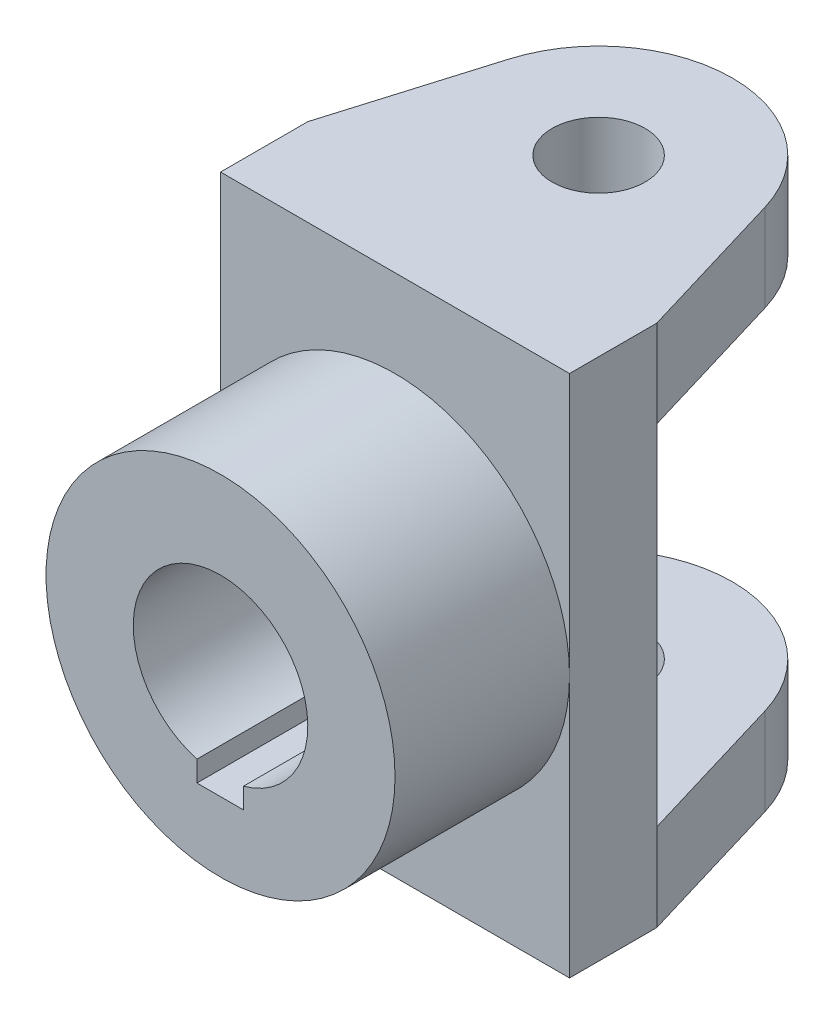
ISO-10303-21;
HEADER;
FILE_DESCRIPTION(('STEP AP214'),'2;1');
FILE_NAME('part.step','',(''),(''),'','','');
FILE_SCHEMA(('AUTOMOTIVE_DESIGN { 1 0 10303 214 1 1 1 1 }'));
ENDSEC;
DATA;
#1=APPLICATION_CONTEXT('core data for automotive mechanical design processes');
#2=APPLICATION_PROTOCOL_DEFINITION('international standard','automotive_design',2000,#1);
#3=PRODUCT_CONTEXT('',#1,'mechanical');
#4=PRODUCT('Part','Part','',(#3));
#5=PRODUCT_RELATED_PRODUCT_CATEGORY('part','',(#4));
#6=PRODUCT_DEFINITION_FORMATION('','',#4);
#7=PRODUCT_DEFINITION_CONTEXT('part definition',#1,'design');
#8=PRODUCT_DEFINITION('design','',#6,#7);
#9=PRODUCT_DEFINITION_SHAPE('','',#8);
#10=(LENGTH_UNIT() NAMED_UNIT(*) SI_UNIT(.MILLI.,.METRE.));
#11=(NAMED_UNIT(*) PLANE_ANGLE_UNIT() SI_UNIT($,.RADIAN.));
#12=(NAMED_UNIT(*) SI_UNIT($,.STERADIAN.) SOLID_ANGLE_UNIT());
#13=UNCERTAINTY_MEASURE_WITH_UNIT(LENGTH_MEASURE(1.E-05),#10,'distance_accuracy_value','');
#14=(GEOMETRIC_REPRESENTATION_CONTEXT(3) GLOBAL_UNCERTAINTY_ASSIGNED_CONTEXT((#13)) GLOBAL_UNIT_ASSIGNED_CONTEXT((#10,
#11,#12)) REPRESENTATION_CONTEXT('',''));
#15=CARTESIAN_POINT('',(0.,0.,0.));
#16=DIRECTION('',(0.,0.,1.));
#17=DIRECTION('',(1.,0.,0.));
#18=AXIS2_PLACEMENT_3D('',#15,#16,#17);
#19=CARTESIAN_POINT('',(0.,0.,0.));
#20=DIRECTION('',(0.,0.,-1.));
#21=DIRECTION('',(-1.,0.,0.));
#22=AXIS2_PLACEMENT_3D('',#19,#20,#21);
#23=PLANE('',#22);
#24=DIRECTION('',(0.,1.,0.));
#25=VECTOR('',#24,1.);
#26=CARTESIAN_POINT('',(30.,-45.,0.));
#27=LINE('',#26,#25);
#28=CARTESIAN_POINT('',(30.,-30.,0.));
#29=VERTEX_POINT('',#28);
#30=CARTESIAN_POINT('',(30.,30.,0.));
#31=VERTEX_POINT('',#30);
#32=EDGE_CURVE('E40',#29,#31,#27,.T.);
#33=ORIENTED_EDGE('',*,*,#32,.F.);
#34=DIRECTION('',(1.,0.,0.));
#35=VECTOR('',#34,1.);
#36=CARTESIAN_POINT('',(-30.,-30.,0.));
#37=LINE('',#36,#35);
#38=CARTESIAN_POINT('',(-30.,-30.,0.));
#39=VERTEX_POINT('',#38);
#40=EDGE_CURVE('E169',#39,#29,#37,.T.);
#41=ORIENTED_EDGE('',*,*,#40,.F.);
#42=DIRECTION('',(0.,-1.,0.));
#43=VECTOR('',#42,1.);
#44=CARTESIAN_POINT('',(-30.,-45.,0.));
#45=LINE('',#44,#43);
#46=CARTESIAN_POINT('',(-30.,30.,0.));
#47=VERTEX_POINT('',#46);
#48=EDGE_CURVE('E289',#47,#39,#45,.T.);
#49=ORIENTED_EDGE('',*,*,#48,.F.);
#50=DIRECTION('',(1.,0.,0.));
#51=VECTOR('',#50,1.);
#52=CARTESIAN_POINT('',(-30.,30.,0.));
#53=LINE('',#52,#51);
#54=EDGE_CURVE('E202',#47,#31,#53,.T.);
#55=ORIENTED_EDGE('',*,*,#54,.T.);
#56=EDGE_LOOP('',(#33,#41,#49,#55));
#57=FACE_BOUND('',#56,.T.);
#58=ADVANCED_FACE('F36',(#57),#23,.T.);
#59=CARTESIAN_POINT('',(0.,0.,15.));
#60=DIRECTION('',(0.,0.,-1.));
#61=DIRECTION('',(-1.,0.,0.));
#62=AXIS2_PLACEMENT_3D('',#59,#60,#61);
#63=PLANE('',#62);
#64=CARTESIAN_POINT('',(0.,0.,15.));
#65=DIRECTION('',(0.,0.,1.));
#66=DIRECTION('',(1.,0.,0.));
#67=AXIS2_PLACEMENT_3D('',#64,#65,#66);
#68=CIRCLE('',#67,30.);
#69=CARTESIAN_POINT('',(30.,0.,15.));
#70=VERTEX_POINT('',#69);
#71=CARTESIAN_POINT('',(-30.,0.,15.));
#72=VERTEX_POINT('',#71);
#73=EDGE_CURVE('E48',#70,#72,#68,.T.);
#74=ORIENTED_EDGE('',*,*,#73,.F.);
#75=DIRECTION('',(0.,1.,0.));
#76=VECTOR('',#75,1.);
#77=CARTESIAN_POINT('',(30.,-45.,15.));
#78=LINE('',#77,#76);
#79=CARTESIAN_POINT('',(30.,45.,15.));
#80=VERTEX_POINT('',#79);
#81=EDGE_CURVE('E274',#70,#80,#78,.T.);
#82=ORIENTED_EDGE('',*,*,#81,.T.);
#83=DIRECTION('',(-1.,0.,0.));
#84=VECTOR('',#83,1.);
#85=CARTESIAN_POINT('',(-30.,45.,15.));
#86=LINE('',#85,#84);
#87=CARTESIAN_POINT('',(-30.,45.,15.));
#88=VERTEX_POINT('',#87);
#89=EDGE_CURVE('E273',#80,#88,#86,.T.);
#90=ORIENTED_EDGE('',*,*,#89,.T.);
#91=DIRECTION('',(0.,-1.,0.));
#92=VECTOR('',#91,1.);
#93=CARTESIAN_POINT('',(-30.,-45.,15.));
#94=LINE('',#93,#92);
#95=EDGE_CURVE('E277',#88,#72,#94,.T.);
#96=ORIENTED_EDGE('',*,*,#95,.T.);
#97=EDGE_LOOP('',(#74,#82,#90,#96));
#98=FACE_BOUND('',#97,.T.);
#99=ADVANCED_FACE('F299',(#98),#63,.F.);
#100=EDGE_CURVE('E11',#72,#70,#68,.T.);
#101=ORIENTED_EDGE('',*,*,#100,.F.);
#102=CARTESIAN_POINT('',(-30.,-45.,15.));
#103=VERTEX_POINT('',#102);
#104=EDGE_CURVE('E276',#72,#103,#94,.T.);
#105=ORIENTED_EDGE('',*,*,#104,.T.);
#106=DIRECTION('',(1.,0.,0.));
#107=VECTOR('',#106,1.);
#108=CARTESIAN_POINT('',(-30.,-45.,15.));
#109=LINE('',#108,#107);
#110=CARTESIAN_POINT('',(30.,-45.,15.));
#111=VERTEX_POINT('',#110);
#112=EDGE_CURVE('E280',#103,#111,#109,.T.);
#113=ORIENTED_EDGE('',*,*,#112,.T.);
#114=EDGE_CURVE('E271',#111,#70,#78,.T.);
#115=ORIENTED_EDGE('',*,*,#114,.T.);
#116=EDGE_LOOP('',(#101,#105,#113,#115));
#117=FACE_BOUND('',#116,.T.);
#118=ADVANCED_FACE('F343',(#117),#63,.F.);
#119=CARTESIAN_POINT('',(30.,-45.,15.));
#120=DIRECTION('',(-1.,0.,0.));
#121=DIRECTION('',(0.,0.,1.));
#122=AXIS2_PLACEMENT_3D('',#119,#120,#121);
#123=PLANE('',#122);
#124=CARTESIAN_POINT('',(30.,-45.,0.));
#125=VERTEX_POINT('',#124);
#126=EDGE_CURVE('E287',#125,#29,#27,.T.);
#127=ORIENTED_EDGE('',*,*,#126,.T.);
#128=ORIENTED_EDGE('',*,*,#32,.T.);
#129=DIRECTION('',(0.,1.,0.));
#130=VECTOR('',#129,1.);
#131=CARTESIAN_POINT('',(30.,30.,0.));
#132=LINE('',#131,#130);
#133=CARTESIAN_POINT('',(30.,45.,0.));
#134=VERTEX_POINT('',#133);
#135=EDGE_CURVE('E215',#31,#134,#132,.T.);
#136=ORIENTED_EDGE('',*,*,#135,.T.);
#137=DIRECTION('',(0.,0.,-1.));
#138=VECTOR('',#137,1.);
#139=CARTESIAN_POINT('',(30.,45.,15.));
#140=LINE('',#139,#138);
#141=EDGE_CURVE('E46',#80,#134,#140,.T.);
#142=ORIENTED_EDGE('',*,*,#141,.F.);
#143=ORIENTED_EDGE('',*,*,#81,.F.);
#144=ORIENTED_EDGE('',*,*,#114,.F.);
#145=DIRECTION('',(0.,0.,-1.));
#146=VECTOR('',#145,1.);
#147=CARTESIAN_POINT('',(30.,-45.,15.));
#148=LINE('',#147,#146);
#149=EDGE_CURVE('E281',#111,#125,#148,.T.);
#150=ORIENTED_EDGE('',*,*,#149,.T.);
#151=EDGE_LOOP('',(#127,#128,#136,#142,#143,#144,#150));
#152=FACE_BOUND('',#151,.T.);
#153=ADVANCED_FACE('F38',(#152),#123,.F.);
#154=CARTESIAN_POINT('',(-30.,45.,15.));
#155=DIRECTION('',(0.,-1.,0.));
#156=DIRECTION('',(0.,0.,-1.));
#157=AXIS2_PLACEMENT_3D('',#154,#155,#156);
#158=PLANE('',#157);
#159=ORIENTED_EDGE('',*,*,#141,.T.);
#160=DIRECTION('',(-0.286928155857607,0.,-0.957952103905071));
#161=VECTOR('',#160,1.);
#162=CARTESIAN_POINT('',(30.,45.,0.));
#163=LINE('',#162,#161);
#164=CARTESIAN_POINT('',(22.0328983898166,45.,-26.599347584725));
#165=VERTEX_POINT('',#164);
#166=EDGE_CURVE('E227',#134,#165,#163,.T.);
#167=ORIENTED_EDGE('',*,*,#166,.T.);
#168=CARTESIAN_POINT('',(0.,45.,-20.));
#169=DIRECTION('',(0.,1.,0.));
#170=DIRECTION('',(0.,0.,1.));
#171=AXIS2_PLACEMENT_3D('',#168,#169,#170);
#172=CIRCLE('',#171,23.);
#173=CARTESIAN_POINT('',(-22.0328983898166,45.,-26.599347584725));
#174=VERTEX_POINT('',#173);
#175=EDGE_CURVE('E221',#165,#174,#172,.T.);
#176=ORIENTED_EDGE('',*,*,#175,.T.);
#177=DIRECTION('',(-0.286928155857607,0.,0.957952103905072));
#178=VECTOR('',#177,1.);
#179=CARTESIAN_POINT('',(-30.,45.,0.));
#180=LINE('',#179,#178);
#181=CARTESIAN_POINT('',(-30.,45.,0.));
#182=VERTEX_POINT('',#181);
#183=EDGE_CURVE('E194',#174,#182,#180,.T.);
#184=ORIENTED_EDGE('',*,*,#183,.T.);
#185=DIRECTION('',(0.,0.,-1.));
#186=VECTOR('',#185,1.);
#187=CARTESIAN_POINT('',(-30.,45.,15.));
#188=LINE('',#187,#186);
#189=EDGE_CURVE('E306',#88,#182,#188,.T.);
#190=ORIENTED_EDGE('',*,*,#189,.F.);
#191=ORIENTED_EDGE('',*,*,#89,.F.);
#192=EDGE_LOOP('',(#159,#167,#176,#184,#190,#191));
#193=FACE_BOUND('',#192,.T.);
#194=CARTESIAN_POINT('',(0.,45.,-20.));
#195=DIRECTION('',(0.,1.,0.));
#196=DIRECTION('',(0.,0.,1.));
#197=AXIS2_PLACEMENT_3D('',#194,#195,#196);
#198=CIRCLE('',#197,8.);
#199=CARTESIAN_POINT('',(0.,45.,-12.));
#200=VERTEX_POINT('',#199);
#201=EDGE_CURVE('E189',#200,#200,#198,.T.);
#202=ORIENTED_EDGE('',*,*,#201,.F.);
#203=EDGE_LOOP('',(#202));
#204=FACE_BOUND('',#203,.T.);
#205=ADVANCED_FACE('F304',(#193,#204),#158,.F.);
#206=CARTESIAN_POINT('',(-30.,-45.,15.));
#207=DIRECTION('',(1.,0.,0.));
#208=DIRECTION('',(0.,0.,-1.));
#209=AXIS2_PLACEMENT_3D('',#206,#207,#208);
#210=PLANE('',#209);
#211=EDGE_CURVE('E208',#182,#47,#45,.T.);
#212=ORIENTED_EDGE('',*,*,#211,.T.);
#213=ORIENTED_EDGE('',*,*,#48,.T.);
#214=DIRECTION('',(0.,-1.,0.));
#215=VECTOR('',#214,1.);
#216=CARTESIAN_POINT('',(-30.,-30.,0.));
#217=LINE('',#216,#215);
#218=CARTESIAN_POINT('',(-30.,-45.,0.));
#219=VERTEX_POINT('',#218);
#220=EDGE_CURVE('E173',#39,#219,#217,.T.);
#221=ORIENTED_EDGE('',*,*,#220,.T.);
#222=DIRECTION('',(0.,0.,-1.));
#223=VECTOR('',#222,1.);
#224=CARTESIAN_POINT('',(-30.,-45.,15.));
#225=LINE('',#224,#223);
#226=EDGE_CURVE('E309',#103,#219,#225,.T.);
#227=ORIENTED_EDGE('',*,*,#226,.F.);
#228=ORIENTED_EDGE('',*,*,#104,.F.);
#229=ORIENTED_EDGE('',*,*,#95,.F.);
#230=ORIENTED_EDGE('',*,*,#189,.T.);
#231=EDGE_LOOP('',(#212,#213,#221,#227,#228,#229,#230));
#232=FACE_BOUND('',#231,.T.);
#233=ADVANCED_FACE('F356',(#232),#210,.F.);
#234=CARTESIAN_POINT('',(-30.,-45.,15.));
#235=DIRECTION('',(0.,1.,0.));
#236=DIRECTION('',(0.,0.,1.));
#237=AXIS2_PLACEMENT_3D('',#234,#235,#236);
#238=PLANE('',#237);
#239=ORIENTED_EDGE('',*,*,#226,.T.);
#240=DIRECTION('',(-0.286928155857607,0.,0.957952103905072));
#241=VECTOR('',#240,1.);
#242=CARTESIAN_POINT('',(-30.,-45.,0.));
#243=LINE('',#242,#241);
#244=CARTESIAN_POINT('',(-22.0328983898166,-45.,-26.599347584725));
#245=VERTEX_POINT('',#244);
#246=EDGE_CURVE('E184',#245,#219,#243,.T.);
#247=ORIENTED_EDGE('',*,*,#246,.F.);
#248=CARTESIAN_POINT('',(0.,-45.,-20.));
#249=DIRECTION('',(0.,1.,0.));
#250=DIRECTION('',(0.,0.,1.));
#251=AXIS2_PLACEMENT_3D('',#248,#249,#250);
#252=CIRCLE('',#251,23.);
#253=CARTESIAN_POINT('',(22.0328983898166,-45.,-26.599347584725));
#254=VERTEX_POINT('',#253);
#255=EDGE_CURVE('E165',#254,#245,#252,.T.);
#256=ORIENTED_EDGE('',*,*,#255,.F.);
#257=DIRECTION('',(-0.286928155857607,0.,-0.957952103905071));
#258=VECTOR('',#257,1.);
#259=CARTESIAN_POINT('',(30.,-45.,0.));
#260=LINE('',#259,#258);
#261=EDGE_CURVE('E175',#125,#254,#260,.T.);
#262=ORIENTED_EDGE('',*,*,#261,.F.);
#263=ORIENTED_EDGE('',*,*,#149,.F.);
#264=ORIENTED_EDGE('',*,*,#112,.F.);
#265=EDGE_LOOP('',(#239,#247,#256,#262,#263,#264));
#266=FACE_BOUND('',#265,.T.);
#267=CARTESIAN_POINT('',(0.,-45.,-20.));
#268=DIRECTION('',(0.,1.,0.));
#269=DIRECTION('',(0.,0.,1.));
#270=AXIS2_PLACEMENT_3D('',#267,#268,#269);
#271=CIRCLE('',#270,8.);
#272=CARTESIAN_POINT('',(0.,-45.,-12.));
#273=VERTEX_POINT('',#272);
#274=EDGE_CURVE('E179',#273,#273,#271,.T.);
#275=ORIENTED_EDGE('',*,*,#274,.T.);
#276=EDGE_LOOP('',(#275));
#277=FACE_BOUND('',#276,.T.);
#278=ADVANCED_FACE('F317',(#266,#277),#238,.F.);
#279=CARTESIAN_POINT('',(0.,0.,45.));
#280=DIRECTION('',(0.,0.,1.));
#281=DIRECTION('',(1.,0.,0.));
#282=AXIS2_PLACEMENT_3D('',#279,#280,#281);
#283=PLANE('',#282);
#284=CARTESIAN_POINT('',(0.,0.,45.));
#285=DIRECTION('',(0.,0.,1.));
#286=DIRECTION('',(1.,0.,0.));
#287=AXIS2_PLACEMENT_3D('',#284,#285,#286);
#288=CIRCLE('',#287,30.);
#289=CARTESIAN_POINT('',(30.,0.,45.));
#290=VERTEX_POINT('',#289);
#291=EDGE_CURVE('E267',#290,#290,#288,.T.);
#292=ORIENTED_EDGE('',*,*,#291,.T.);
#293=EDGE_LOOP('',(#292));
#294=FACE_BOUND('',#293,.T.);
#295=DIRECTION('',(0.,1.,0.));
#296=VECTOR('',#295,1.);
#297=CARTESIAN_POINT('',(3.94187726838371,-14.4727883837566,45.));
#298=LINE('',#297,#296);
#299=CARTESIAN_POINT('',(3.94187726838371,-17.9998873911796,45.));
#300=VERTEX_POINT('',#299);
#301=CARTESIAN_POINT('',(3.94187726838371,-14.4727883837566,45.));
#302=VERTEX_POINT('',#301);
#303=EDGE_CURVE('E241',#300,#302,#298,.T.);
#304=ORIENTED_EDGE('',*,*,#303,.F.);
#305=DIRECTION('',(1.,0.,0.));
#306=VECTOR('',#305,1.);
#307=CARTESIAN_POINT('',(-4.0581227316163,-17.9998873911796,45.));
#308=LINE('',#307,#306);
#309=CARTESIAN_POINT('',(-4.0581227316163,-17.9998873911796,45.));
#310=VERTEX_POINT('',#309);
#311=EDGE_CURVE('E239',#310,#300,#308,.T.);
#312=ORIENTED_EDGE('',*,*,#311,.F.);
#313=DIRECTION('',(0.,-1.,0.));
#314=VECTOR('',#313,1.);
#315=CARTESIAN_POINT('',(-4.0581227316163,-14.4406246365986,45.));
#316=LINE('',#315,#314);
#317=CARTESIAN_POINT('',(-4.0581227316163,-14.4406246365986,45.));
#318=VERTEX_POINT('',#317);
#319=EDGE_CURVE('E247',#318,#310,#316,.T.);
#320=ORIENTED_EDGE('',*,*,#319,.F.);
#321=CARTESIAN_POINT('',(0.,0.,45.));
#322=DIRECTION('',(0.,0.,1.));
#323=DIRECTION('',(1.,0.,0.));
#324=AXIS2_PLACEMENT_3D('',#321,#322,#323);
#325=CIRCLE('',#324,15.);
#326=EDGE_CURVE('E244',#302,#318,#325,.T.);
#327=ORIENTED_EDGE('',*,*,#326,.F.);
#328=EDGE_LOOP('',(#304,#312,#320,#327));
#329=FACE_BOUND('',#328,.T.);
#330=ADVANCED_FACE('F355',(#294,#329),#283,.T.);
#331=CARTESIAN_POINT('',(0.,0.,45.));
#332=DIRECTION('',(0.,0.,-1.));
#333=DIRECTION('',(-1.,0.,0.));
#334=AXIS2_PLACEMENT_3D('',#331,#332,#333);
#335=CYLINDRICAL_SURFACE('',#334,30.);
#336=ORIENTED_EDGE('',*,*,#291,.F.);
#337=EDGE_LOOP('',(#336));
#338=FACE_BOUND('',#337,.T.);
#339=ORIENTED_EDGE('',*,*,#73,.T.);
#340=ORIENTED_EDGE('',*,*,#100,.T.);
#341=EDGE_LOOP('',(#339,#340));
#342=FACE_BOUND('',#341,.T.);
#343=ADVANCED_FACE('F371',(#338,#342),#335,.T.);
#344=CARTESIAN_POINT('',(-4.0581227316163,-17.9998873911796,45.));
#345=DIRECTION('',(0.,1.,0.));
#346=DIRECTION('',(0.,0.,1.));
#347=AXIS2_PLACEMENT_3D('',#344,#345,#346);
#348=PLANE('',#347);
#349=DIRECTION('',(1.,0.,0.));
#350=VECTOR('',#349,1.);
#351=CARTESIAN_POINT('',(-4.0581227316163,-17.9998873911796,15.));
#352=LINE('',#351,#350);
#353=CARTESIAN_POINT('',(-4.0581227316163,-17.9998873911796,15.));
#354=VERTEX_POINT('',#353);
#355=CARTESIAN_POINT('',(3.94187726838371,-17.9998873911796,15.));
#356=VERTEX_POINT('',#355);
#357=EDGE_CURVE('E237',#354,#356,#352,.T.);
#358=ORIENTED_EDGE('',*,*,#357,.F.);
#359=DIRECTION('',(0.,0.,-1.));
#360=VECTOR('',#359,1.);
#361=CARTESIAN_POINT('',(-4.0581227316163,-17.9998873911796,45.));
#362=LINE('',#361,#360);
#363=EDGE_CURVE('E62',#310,#354,#362,.T.);
#364=ORIENTED_EDGE('',*,*,#363,.F.);
#365=ORIENTED_EDGE('',*,*,#311,.T.);
#366=DIRECTION('',(0.,0.,-1.));
#367=VECTOR('',#366,1.);
#368=CARTESIAN_POINT('',(3.94187726838371,-17.9998873911796,45.));
#369=LINE('',#368,#367);
#370=EDGE_CURVE('E264',#300,#356,#369,.T.);
#371=ORIENTED_EDGE('',*,*,#370,.T.);
#372=EDGE_LOOP('',(#358,#364,#365,#371));
#373=FACE_BOUND('',#372,.T.);
#374=ADVANCED_FACE('F373',(#373),#348,.T.);
#375=CARTESIAN_POINT('',(3.94187726838371,-14.4727883837566,45.));
#376=DIRECTION('',(-1.,0.,0.));
#377=DIRECTION('',(0.,-1.,0.));
#378=AXIS2_PLACEMENT_3D('',#375,#376,#377);
#379=PLANE('',#378);
#380=DIRECTION('',(0.,1.,0.));
#381=VECTOR('',#380,1.);
#382=CARTESIAN_POINT('',(3.94187726838371,-14.4727883837566,15.));
#383=LINE('',#382,#381);
#384=CARTESIAN_POINT('',(3.94187726838371,-14.4727883837566,15.));
#385=VERTEX_POINT('',#384);
#386=EDGE_CURVE('E251',#356,#385,#383,.T.);
#387=ORIENTED_EDGE('',*,*,#386,.F.);
#388=ORIENTED_EDGE('',*,*,#370,.F.);
#389=ORIENTED_EDGE('',*,*,#303,.T.);
#390=DIRECTION('',(0.,0.,-1.));
#391=VECTOR('',#390,1.);
#392=CARTESIAN_POINT('',(3.94187726838371,-14.4727883837566,45.));
#393=LINE('',#392,#391);
#394=EDGE_CURVE('E262',#302,#385,#393,.T.);
#395=ORIENTED_EDGE('',*,*,#394,.T.);
#396=EDGE_LOOP('',(#387,#388,#389,#395));
#397=FACE_BOUND('',#396,.T.);
#398=ADVANCED_FACE('F379',(#397),#379,.T.);
#399=CARTESIAN_POINT('',(0.,0.,45.));
#400=DIRECTION('',(0.,0.,-1.));
#401=DIRECTION('',(-1.,0.,0.));
#402=AXIS2_PLACEMENT_3D('',#399,#400,#401);
#403=CYLINDRICAL_SURFACE('',#402,15.);
#404=CARTESIAN_POINT('',(0.,0.,15.));
#405=DIRECTION('',(0.,0.,1.));
#406=DIRECTION('',(1.,0.,0.));
#407=AXIS2_PLACEMENT_3D('',#404,#405,#406);
#408=CIRCLE('',#407,15.);
#409=CARTESIAN_POINT('',(-4.0581227316163,-14.4406246365986,15.));
#410=VERTEX_POINT('',#409);
#411=EDGE_CURVE('E254',#385,#410,#408,.T.);
#412=ORIENTED_EDGE('',*,*,#411,.F.);
#413=ORIENTED_EDGE('',*,*,#394,.F.);
#414=ORIENTED_EDGE('',*,*,#326,.T.);
#415=DIRECTION('',(0.,0.,-1.));
#416=VECTOR('',#415,1.);
#417=CARTESIAN_POINT('',(-4.0581227316163,-14.4406246365986,45.));
#418=LINE('',#417,#416);
#419=EDGE_CURVE('E260',#318,#410,#418,.T.);
#420=ORIENTED_EDGE('',*,*,#419,.T.);
#421=EDGE_LOOP('',(#412,#413,#414,#420));
#422=FACE_BOUND('',#421,.T.);
#423=ADVANCED_FACE('F388',(#422),#403,.F.);
#424=CARTESIAN_POINT('',(-4.0581227316163,-14.4406246365986,45.));
#425=DIRECTION('',(1.,0.,0.));
#426=DIRECTION('',(0.,1.,0.));
#427=AXIS2_PLACEMENT_3D('',#424,#425,#426);
#428=PLANE('',#427);
#429=DIRECTION('',(0.,-1.,0.));
#430=VECTOR('',#429,1.);
#431=CARTESIAN_POINT('',(-4.0581227316163,-14.4406246365986,15.));
#432=LINE('',#431,#430);
#433=EDGE_CURVE('E242',#410,#354,#432,.T.);
#434=ORIENTED_EDGE('',*,*,#433,.F.);
#435=ORIENTED_EDGE('',*,*,#419,.F.);
#436=ORIENTED_EDGE('',*,*,#319,.T.);
#437=ORIENTED_EDGE('',*,*,#363,.T.);
#438=EDGE_LOOP('',(#434,#435,#436,#437));
#439=FACE_BOUND('',#438,.T.);
#440=ADVANCED_FACE('F340',(#439),#428,.T.);
#441=ORIENTED_EDGE('',*,*,#433,.T.);
#442=ORIENTED_EDGE('',*,*,#357,.T.);
#443=ORIENTED_EDGE('',*,*,#386,.T.);
#444=ORIENTED_EDGE('',*,*,#411,.T.);
#445=EDGE_LOOP('',(#441,#442,#443,#444));
#446=FACE_BOUND('',#445,.T.);
#447=ADVANCED_FACE('F333',(#446),#63,.F.);
#448=CARTESIAN_POINT('',(-30.,30.,0.));
#449=DIRECTION('',(-0.957952103905071,0.,-0.286928155857607));
#450=DIRECTION('',(-0.286928155857607,0.,0.957952103905072));
#451=AXIS2_PLACEMENT_3D('',#448,#449,#450);
#452=PLANE('',#451);
#453=ORIENTED_EDGE('',*,*,#183,.F.);
#454=DIRECTION('',(0.,1.,0.));
#455=VECTOR('',#454,1.);
#456=CARTESIAN_POINT('',(-22.0328983898166,30.,-26.599347584725));
#457=LINE('',#456,#455);
#458=CARTESIAN_POINT('',(-22.0328983898166,30.,-26.599347584725));
#459=VERTEX_POINT('',#458);
#460=EDGE_CURVE('E235',#459,#174,#457,.T.);
#461=ORIENTED_EDGE('',*,*,#460,.F.);
#462=DIRECTION('',(-0.286928155857607,0.,0.957952103905072));
#463=VECTOR('',#462,1.);
#464=CARTESIAN_POINT('',(-30.,30.,0.));
#465=LINE('',#464,#463);
#466=EDGE_CURVE('E207',#459,#47,#465,.T.);
#467=ORIENTED_EDGE('',*,*,#466,.T.);
#468=ORIENTED_EDGE('',*,*,#211,.F.);
#469=EDGE_LOOP('',(#453,#461,#467,#468));
#470=FACE_BOUND('',#469,.T.);
#471=ADVANCED_FACE('F331',(#470),#452,.T.);
#472=CARTESIAN_POINT('',(0.,30.,-20.));
#473=DIRECTION('',(0.,1.,0.));
#474=DIRECTION('',(0.,0.,1.));
#475=AXIS2_PLACEMENT_3D('',#472,#473,#474);
#476=CYLINDRICAL_SURFACE('',#475,23.);
#477=ORIENTED_EDGE('',*,*,#175,.F.);
#478=DIRECTION('',(0.,1.,0.));
#479=VECTOR('',#478,1.);
#480=CARTESIAN_POINT('',(22.0328983898166,30.,-26.599347584725));
#481=LINE('',#480,#479);
#482=CARTESIAN_POINT('',(22.0328983898166,30.,-26.599347584725));
#483=VERTEX_POINT('',#482);
#484=EDGE_CURVE('E217',#483,#165,#481,.T.);
#485=ORIENTED_EDGE('',*,*,#484,.F.);
#486=CARTESIAN_POINT('',(0.,30.,-20.));
#487=DIRECTION('',(0.,1.,0.));
#488=DIRECTION('',(0.,0.,1.));
#489=AXIS2_PLACEMENT_3D('',#486,#487,#488);
#490=CIRCLE('',#489,23.);
#491=EDGE_CURVE('E199',#483,#459,#490,.T.);
#492=ORIENTED_EDGE('',*,*,#491,.T.);
#493=ORIENTED_EDGE('',*,*,#460,.T.);
#494=EDGE_LOOP('',(#477,#485,#492,#493));
#495=FACE_BOUND('',#494,.T.);
#496=ADVANCED_FACE('F329',(#495),#476,.T.);
#497=CARTESIAN_POINT('',(30.,30.,0.));
#498=DIRECTION('',(0.957952103905071,0.,-0.286928155857607));
#499=DIRECTION('',(-0.286928155857607,0.,-0.957952103905072));
#500=AXIS2_PLACEMENT_3D('',#497,#498,#499);
#501=PLANE('',#500);
#502=ORIENTED_EDGE('',*,*,#166,.F.);
#503=ORIENTED_EDGE('',*,*,#135,.F.);
#504=DIRECTION('',(-0.286928155857607,0.,-0.957952103905071));
#505=VECTOR('',#504,1.);
#506=CARTESIAN_POINT('',(30.,30.,0.));
#507=LINE('',#506,#505);
#508=EDGE_CURVE('E206',#31,#483,#507,.T.);
#509=ORIENTED_EDGE('',*,*,#508,.T.);
#510=ORIENTED_EDGE('',*,*,#484,.T.);
#511=EDGE_LOOP('',(#502,#503,#509,#510));
#512=FACE_BOUND('',#511,.T.);
#513=ADVANCED_FACE('F327',(#512),#501,.T.);
#514=CARTESIAN_POINT('',(0.,30.,-20.));
#515=DIRECTION('',(0.,1.,0.));
#516=DIRECTION('',(0.,0.,1.));
#517=AXIS2_PLACEMENT_3D('',#514,#515,#516);
#518=PLANE('',#517);
#519=CARTESIAN_POINT('',(0.,30.,-20.));
#520=DIRECTION('',(0.,1.,0.));
#521=DIRECTION('',(0.,0.,1.));
#522=AXIS2_PLACEMENT_3D('',#519,#520,#521);
#523=CIRCLE('',#522,8.);
#524=CARTESIAN_POINT('',(0.,30.,-12.));
#525=VERTEX_POINT('',#524);
#526=EDGE_CURVE('E191',#525,#525,#523,.T.);
#527=ORIENTED_EDGE('',*,*,#526,.T.);
#528=EDGE_LOOP('',(#527));
#529=FACE_BOUND('',#528,.T.);
#530=ORIENTED_EDGE('',*,*,#466,.F.);
#531=ORIENTED_EDGE('',*,*,#491,.F.);
#532=ORIENTED_EDGE('',*,*,#508,.F.);
#533=ORIENTED_EDGE('',*,*,#54,.F.);
#534=EDGE_LOOP('',(#530,#531,#532,#533));
#535=FACE_BOUND('',#534,.T.);
#536=ADVANCED_FACE('F323',(#529,#535),#518,.F.);
#537=CARTESIAN_POINT('',(0.,30.,-20.));
#538=DIRECTION('',(0.,1.,0.));
#539=DIRECTION('',(0.,0.,1.));
#540=AXIS2_PLACEMENT_3D('',#537,#538,#539);
#541=CYLINDRICAL_SURFACE('',#540,8.);
#542=ORIENTED_EDGE('',*,*,#526,.F.);
#543=EDGE_LOOP('',(#542));
#544=FACE_BOUND('',#543,.T.);
#545=ORIENTED_EDGE('',*,*,#201,.T.);
#546=EDGE_LOOP('',(#545));
#547=FACE_BOUND('',#546,.T.);
#548=ADVANCED_FACE('F442',(#544,#547),#541,.F.);
#549=CARTESIAN_POINT('',(0.,-30.,-20.));
#550=DIRECTION('',(0.,-1.,0.));
#551=DIRECTION('',(0.,0.,1.));
#552=AXIS2_PLACEMENT_3D('',#549,#550,#551);
#553=PLANE('',#552);
#554=DIRECTION('',(-0.286928155857607,0.,0.957952103905072));
#555=VECTOR('',#554,1.);
#556=CARTESIAN_POINT('',(-30.,-30.,0.));
#557=LINE('',#556,#555);
#558=CARTESIAN_POINT('',(-22.0328983898166,-30.,-26.599347584725));
#559=VERTEX_POINT('',#558);
#560=EDGE_CURVE('E153',#559,#39,#557,.T.);
#561=ORIENTED_EDGE('',*,*,#560,.T.);
#562=ORIENTED_EDGE('',*,*,#40,.T.);
#563=DIRECTION('',(-0.286928155857607,0.,-0.957952103905071));
#564=VECTOR('',#563,1.);
#565=CARTESIAN_POINT('',(30.,-30.,0.));
#566=LINE('',#565,#564);
#567=CARTESIAN_POINT('',(22.0328983898166,-30.,-26.599347584725));
#568=VERTEX_POINT('',#567);
#569=EDGE_CURVE('E156',#29,#568,#566,.T.);
#570=ORIENTED_EDGE('',*,*,#569,.T.);
#571=CARTESIAN_POINT('',(0.,-30.,-20.));
#572=DIRECTION('',(0.,1.,0.));
#573=DIRECTION('',(0.,0.,1.));
#574=AXIS2_PLACEMENT_3D('',#571,#572,#573);
#575=CIRCLE('',#574,23.);
#576=EDGE_CURVE('E148',#568,#559,#575,.T.);
#577=ORIENTED_EDGE('',*,*,#576,.T.);
#578=EDGE_LOOP('',(#561,#562,#570,#577));
#579=FACE_BOUND('',#578,.T.);
#580=CARTESIAN_POINT('',(0.,-30.,-20.));
#581=DIRECTION('',(0.,1.,0.));
#582=DIRECTION('',(0.,0.,1.));
#583=AXIS2_PLACEMENT_3D('',#580,#581,#582);
#584=CIRCLE('',#583,8.);
#585=CARTESIAN_POINT('',(0.,-30.,-12.));
#586=VERTEX_POINT('',#585);
#587=EDGE_CURVE('E186',#586,#586,#584,.T.);
#588=ORIENTED_EDGE('',*,*,#587,.F.);
#589=EDGE_LOOP('',(#588));
#590=FACE_BOUND('',#589,.T.);
#591=ADVANCED_FACE('F150',(#579,#590),#553,.F.);
#592=CARTESIAN_POINT('',(-30.,-30.,0.));
#593=DIRECTION('',(0.957952103905071,0.,0.286928155857607));
#594=DIRECTION('',(0.286928155857607,0.,-0.957952103905072));
#595=AXIS2_PLACEMENT_3D('',#592,#593,#594);
#596=PLANE('',#595);
#597=ORIENTED_EDGE('',*,*,#246,.T.);
#598=ORIENTED_EDGE('',*,*,#220,.F.);
#599=ORIENTED_EDGE('',*,*,#560,.F.);
#600=DIRECTION('',(0.,-1.,0.));
#601=VECTOR('',#600,1.);
#602=CARTESIAN_POINT('',(-22.0328983898166,-30.,-26.599347584725));
#603=LINE('',#602,#601);
#604=EDGE_CURVE('E162',#559,#245,#603,.T.);
#605=ORIENTED_EDGE('',*,*,#604,.T.);
#606=EDGE_LOOP('',(#597,#598,#599,#605));
#607=FACE_BOUND('',#606,.T.);
#608=ADVANCED_FACE('F171',(#607),#596,.F.);
#609=CARTESIAN_POINT('',(30.,-30.,0.));
#610=DIRECTION('',(-0.957952103905071,0.,0.286928155857607));
#611=DIRECTION('',(0.286928155857607,0.,0.957952103905072));
#612=AXIS2_PLACEMENT_3D('',#609,#610,#611);
#613=PLANE('',#612);
#614=ORIENTED_EDGE('',*,*,#261,.T.);
#615=DIRECTION('',(0.,-1.,0.));
#616=VECTOR('',#615,1.);
#617=CARTESIAN_POINT('',(22.0328983898166,-30.,-26.599347584725));
#618=LINE('',#617,#616);
#619=EDGE_CURVE('E168',#568,#254,#618,.T.);
#620=ORIENTED_EDGE('',*,*,#619,.F.);
#621=ORIENTED_EDGE('',*,*,#569,.F.);
#622=ORIENTED_EDGE('',*,*,#126,.F.);
#623=EDGE_LOOP('',(#614,#620,#621,#622));
#624=FACE_BOUND('',#623,.T.);
#625=ADVANCED_FACE('F320',(#624),#613,.F.);
#626=CARTESIAN_POINT('',(0.,-30.,-20.));
#627=DIRECTION('',(0.,-1.,0.));
#628=DIRECTION('',(0.,0.,-1.));
#629=AXIS2_PLACEMENT_3D('',#626,#627,#628);
#630=CYLINDRICAL_SURFACE('',#629,23.);
#631=ORIENTED_EDGE('',*,*,#255,.T.);
#632=ORIENTED_EDGE('',*,*,#604,.F.);
#633=ORIENTED_EDGE('',*,*,#576,.F.);
#634=ORIENTED_EDGE('',*,*,#619,.T.);
#635=EDGE_LOOP('',(#631,#632,#633,#634));
#636=FACE_BOUND('',#635,.T.);
#637=ADVANCED_FACE('F163',(#636),#630,.T.);
#638=CARTESIAN_POINT('',(0.,-30.,-20.));
#639=DIRECTION('',(0.,-1.,0.));
#640=DIRECTION('',(0.,0.,-1.));
#641=AXIS2_PLACEMENT_3D('',#638,#639,#640);
#642=CYLINDRICAL_SURFACE('',#641,8.);
#643=ORIENTED_EDGE('',*,*,#587,.T.);
#644=EDGE_LOOP('',(#643));
#645=FACE_BOUND('',#644,.T.);
#646=ORIENTED_EDGE('',*,*,#274,.F.);
#647=EDGE_LOOP('',(#646));
#648=FACE_BOUND('',#647,.T.);
#649=ADVANCED_FACE('F505',(#645,#648),#642,.F.);
#650=CLOSED_SHELL('',(#58,#99,#118,#153,#205,#233,#278,#330,#343,#374,#398,#423,#440,#447,#471,
#496,#513,#536,#548,#591,#608,#625,#637,#649));
#651=MANIFOLD_SOLID_BREP('B2',#650);
#652=ADVANCED_BREP_SHAPE_REPRESENTATION('',(#18,#651),#14);
#653=SHAPE_DEFINITION_REPRESENTATION(#9,#652);
ENDSEC;
END-ISO-10303-21;
